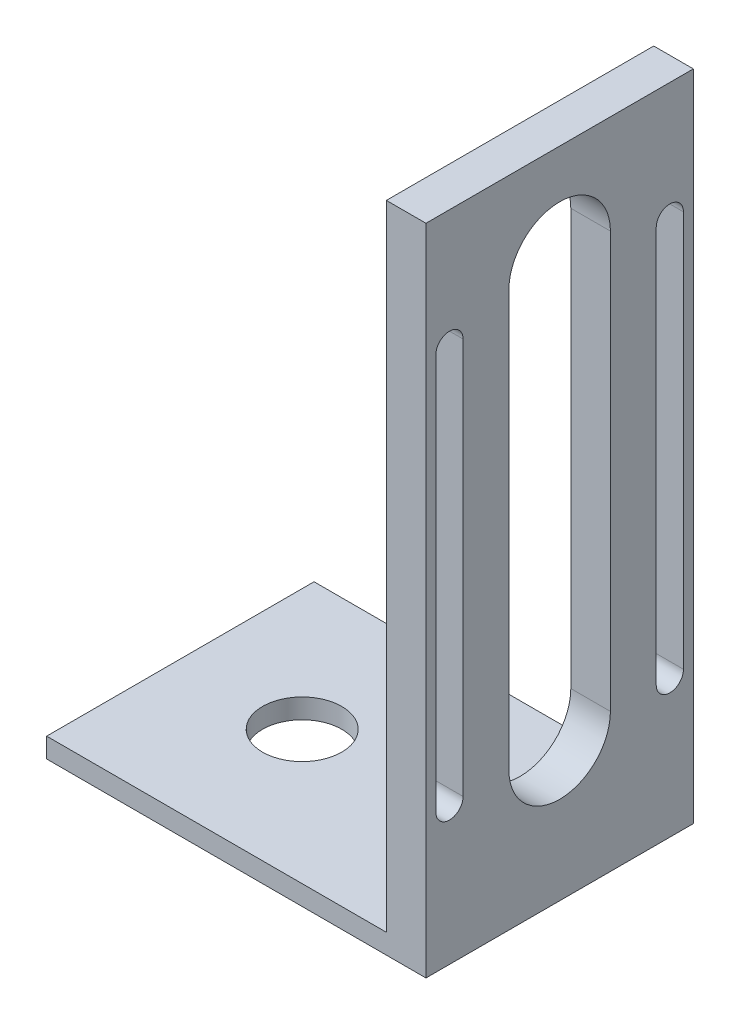
ISO-10303-21;
HEADER;
FILE_DESCRIPTION(('STEP AP214'),'2;1');
FILE_NAME('part.step','',(''),(''),'','','');
FILE_SCHEMA(('AUTOMOTIVE_DESIGN { 1 0 10303 214 1 1 1 1 }'));
ENDSEC;
DATA;
#1=APPLICATION_CONTEXT('core data for automotive mechanical design processes');
#2=APPLICATION_PROTOCOL_DEFINITION('international standard','automotive_design',2000,#1);
#3=PRODUCT_CONTEXT('',#1,'mechanical');
#4=PRODUCT('Part','Part','',(#3));
#5=PRODUCT_RELATED_PRODUCT_CATEGORY('part','',(#4));
#6=PRODUCT_DEFINITION_FORMATION('','',#4);
#7=PRODUCT_DEFINITION_CONTEXT('part definition',#1,'design');
#8=PRODUCT_DEFINITION('design','',#6,#7);
#9=PRODUCT_DEFINITION_SHAPE('','',#8);
#10=(LENGTH_UNIT() NAMED_UNIT(*) SI_UNIT(.MILLI.,.METRE.));
#11=(NAMED_UNIT(*) PLANE_ANGLE_UNIT() SI_UNIT($,.RADIAN.));
#12=(NAMED_UNIT(*) SI_UNIT($,.STERADIAN.) SOLID_ANGLE_UNIT());
#13=UNCERTAINTY_MEASURE_WITH_UNIT(LENGTH_MEASURE(1.E-05),#10,'distance_accuracy_value','');
#14=(GEOMETRIC_REPRESENTATION_CONTEXT(3) GLOBAL_UNCERTAINTY_ASSIGNED_CONTEXT((#13)) GLOBAL_UNIT_ASSIGNED_CONTEXT((#10,
#11,#12)) REPRESENTATION_CONTEXT('',''));
#15=CARTESIAN_POINT('',(0.,0.,0.));
#16=DIRECTION('',(0.,0.,1.));
#17=DIRECTION('',(1.,0.,0.));
#18=AXIS2_PLACEMENT_3D('',#15,#16,#17);
#19=CARTESIAN_POINT('',(0.,2.,0.));
#20=DIRECTION('',(0.,1.,0.));
#21=DIRECTION('',(0.,0.,1.));
#22=AXIS2_PLACEMENT_3D('',#19,#20,#21);
#23=PLANE('',#22);
#24=DIRECTION('',(0.,0.,1.));
#25=VECTOR('',#24,1.);
#26=CARTESIAN_POINT('',(15.15,2.,-13.5));
#27=LINE('',#26,#25);
#28=CARTESIAN_POINT('',(15.15,2.,-13.5));
#29=VERTEX_POINT('',#28);
#30=CARTESIAN_POINT('',(15.15,2.,13.5));
#31=VERTEX_POINT('',#30);
#32=EDGE_CURVE('E184',#29,#31,#27,.T.);
#33=ORIENTED_EDGE('',*,*,#32,.F.);
#34=DIRECTION('',(-1.,0.,0.));
#35=VECTOR('',#34,1.);
#36=CARTESIAN_POINT('',(-19.15,2.,-13.5));
#37=LINE('',#36,#35);
#38=CARTESIAN_POINT('',(-19.15,2.,-13.5));
#39=VERTEX_POINT('',#38);
#40=EDGE_CURVE('E334',#29,#39,#37,.T.);
#41=ORIENTED_EDGE('',*,*,#40,.T.);
#42=DIRECTION('',(0.,0.,1.));
#43=VECTOR('',#42,1.);
#44=CARTESIAN_POINT('',(-19.15,2.,-13.5));
#45=LINE('',#44,#43);
#46=CARTESIAN_POINT('',(-19.15,2.,13.5));
#47=VERTEX_POINT('',#46);
#48=EDGE_CURVE('E337',#39,#47,#45,.T.);
#49=ORIENTED_EDGE('',*,*,#48,.T.);
#50=DIRECTION('',(1.,0.,0.));
#51=VECTOR('',#50,1.);
#52=CARTESIAN_POINT('',(-19.15,2.,13.5));
#53=LINE('',#52,#51);
#54=EDGE_CURVE('E341',#47,#31,#53,.T.);
#55=ORIENTED_EDGE('',*,*,#54,.T.);
#56=EDGE_LOOP('',(#33,#41,#49,#55));
#57=FACE_BOUND('',#56,.T.);
#58=CARTESIAN_POINT('',(-6.85,2.,0.));
#59=DIRECTION('',(0.,1.,0.));
#60=DIRECTION('',(0.,0.,1.));
#61=AXIS2_PLACEMENT_3D('',#58,#59,#60);
#62=CIRCLE('',#61,4.);
#63=CARTESIAN_POINT('',(-6.85,2.,4.));
#64=VERTEX_POINT('',#63);
#65=EDGE_CURVE('E326',#64,#64,#62,.T.);
#66=ORIENTED_EDGE('',*,*,#65,.F.);
#67=EDGE_LOOP('',(#66));
#68=FACE_BOUND('',#67,.T.);
#69=ADVANCED_FACE('F38',(#57,#68),#23,.T.);
#70=CARTESIAN_POINT('',(0.,0.,0.));
#71=DIRECTION('',(0.,1.,0.));
#72=DIRECTION('',(0.,0.,1.));
#73=AXIS2_PLACEMENT_3D('',#70,#71,#72);
#74=PLANE('',#73);
#75=DIRECTION('',(0.,0.,-1.));
#76=VECTOR('',#75,1.);
#77=CARTESIAN_POINT('',(19.15,0.,-13.5));
#78=LINE('',#77,#76);
#79=CARTESIAN_POINT('',(19.15,0.,13.5));
#80=VERTEX_POINT('',#79);
#81=CARTESIAN_POINT('',(19.15,0.,-13.5));
#82=VERTEX_POINT('',#81);
#83=EDGE_CURVE('E330',#80,#82,#78,.T.);
#84=ORIENTED_EDGE('',*,*,#83,.F.);
#85=DIRECTION('',(1.,0.,0.));
#86=VECTOR('',#85,1.);
#87=CARTESIAN_POINT('',(-19.15,0.,13.5));
#88=LINE('',#87,#86);
#89=CARTESIAN_POINT('',(-19.15,0.,13.5));
#90=VERTEX_POINT('',#89);
#91=EDGE_CURVE('E338',#90,#80,#88,.T.);
#92=ORIENTED_EDGE('',*,*,#91,.F.);
#93=DIRECTION('',(0.,0.,1.));
#94=VECTOR('',#93,1.);
#95=CARTESIAN_POINT('',(-19.15,0.,-13.5));
#96=LINE('',#95,#94);
#97=CARTESIAN_POINT('',(-19.15,0.,-13.5));
#98=VERTEX_POINT('',#97);
#99=EDGE_CURVE('E351',#98,#90,#96,.T.);
#100=ORIENTED_EDGE('',*,*,#99,.F.);
#101=DIRECTION('',(-1.,0.,0.));
#102=VECTOR('',#101,1.);
#103=CARTESIAN_POINT('',(-19.15,0.,-13.5));
#104=LINE('',#103,#102);
#105=EDGE_CURVE('E348',#82,#98,#104,.T.);
#106=ORIENTED_EDGE('',*,*,#105,.F.);
#107=EDGE_LOOP('',(#84,#92,#100,#106));
#108=FACE_BOUND('',#107,.T.);
#109=CARTESIAN_POINT('',(-6.85,0.,0.));
#110=DIRECTION('',(0.,1.,0.));
#111=DIRECTION('',(0.,0.,1.));
#112=AXIS2_PLACEMENT_3D('',#109,#110,#111);
#113=CIRCLE('',#112,4.);
#114=CARTESIAN_POINT('',(-6.85,0.,4.));
#115=VERTEX_POINT('',#114);
#116=EDGE_CURVE('E325',#115,#115,#113,.T.);
#117=ORIENTED_EDGE('',*,*,#116,.T.);
#118=EDGE_LOOP('',(#117));
#119=FACE_BOUND('',#118,.T.);
#120=ADVANCED_FACE('F375',(#108,#119),#74,.F.);
#121=CARTESIAN_POINT('',(19.15,2.,-13.5));
#122=DIRECTION('',(-1.,0.,0.));
#123=DIRECTION('',(0.,0.,1.));
#124=AXIS2_PLACEMENT_3D('',#121,#122,#123);
#125=PLANE('',#124);
#126=DIRECTION('',(0.,1.,0.));
#127=VECTOR('',#126,1.);
#128=CARTESIAN_POINT('',(19.15,14.,-12.5));
#129=LINE('',#128,#127);
#130=CARTESIAN_POINT('',(19.15,14.,-12.5));
#131=VERTEX_POINT('',#130);
#132=CARTESIAN_POINT('',(19.15,54.,-12.5));
#133=VERTEX_POINT('',#132);
#134=EDGE_CURVE('E189',#131,#133,#129,.T.);
#135=ORIENTED_EDGE('',*,*,#134,.F.);
#136=CARTESIAN_POINT('',(19.15,14.,-11.125));
#137=DIRECTION('',(-1.,0.,0.));
#138=DIRECTION('',(0.,0.,1.));
#139=AXIS2_PLACEMENT_3D('',#136,#137,#138);
#140=CIRCLE('',#139,1.375);
#141=CARTESIAN_POINT('',(19.15,14.,-9.75));
#142=VERTEX_POINT('',#141);
#143=EDGE_CURVE('E168',#142,#131,#140,.F.);
#144=ORIENTED_EDGE('',*,*,#143,.F.);
#145=DIRECTION('',(0.,-1.,0.));
#146=VECTOR('',#145,1.);
#147=CARTESIAN_POINT('',(19.15,14.,-9.75));
#148=LINE('',#147,#146);
#149=CARTESIAN_POINT('',(19.15,54.,-9.75));
#150=VERTEX_POINT('',#149);
#151=EDGE_CURVE('E180',#150,#142,#148,.T.);
#152=ORIENTED_EDGE('',*,*,#151,.F.);
#153=CARTESIAN_POINT('',(19.15,54.,-11.125));
#154=DIRECTION('',(-1.,0.,0.));
#155=DIRECTION('',(0.,0.,1.));
#156=AXIS2_PLACEMENT_3D('',#153,#154,#155);
#157=CIRCLE('',#156,1.375);
#158=EDGE_CURVE('E54',#133,#150,#157,.F.);
#159=ORIENTED_EDGE('',*,*,#158,.F.);
#160=EDGE_LOOP('',(#135,#144,#152,#159));
#161=FACE_BOUND('',#160,.T.);
#162=DIRECTION('',(0.,1.,0.));
#163=VECTOR('',#162,1.);
#164=CARTESIAN_POINT('',(19.15,14.,9.75));
#165=LINE('',#164,#163);
#166=CARTESIAN_POINT('',(19.15,14.,9.75));
#167=VERTEX_POINT('',#166);
#168=CARTESIAN_POINT('',(19.15,54.,9.75));
#169=VERTEX_POINT('',#168);
#170=EDGE_CURVE('E217',#167,#169,#165,.T.);
#171=ORIENTED_EDGE('',*,*,#170,.F.);
#172=CARTESIAN_POINT('',(19.15,14.,11.125));
#173=DIRECTION('',(-1.,0.,0.));
#174=DIRECTION('',(0.,0.,1.));
#175=AXIS2_PLACEMENT_3D('',#172,#173,#174);
#176=CIRCLE('',#175,1.375);
#177=CARTESIAN_POINT('',(19.15,14.,12.5));
#178=VERTEX_POINT('',#177);
#179=EDGE_CURVE('E222',#178,#167,#176,.F.);
#180=ORIENTED_EDGE('',*,*,#179,.F.);
#181=DIRECTION('',(0.,-1.,0.));
#182=VECTOR('',#181,1.);
#183=CARTESIAN_POINT('',(19.15,14.,12.5));
#184=LINE('',#183,#182);
#185=CARTESIAN_POINT('',(19.15,54.,12.5));
#186=VERTEX_POINT('',#185);
#187=EDGE_CURVE('E245',#186,#178,#184,.T.);
#188=ORIENTED_EDGE('',*,*,#187,.F.);
#189=CARTESIAN_POINT('',(19.15,54.,11.125));
#190=DIRECTION('',(-1.,0.,0.));
#191=DIRECTION('',(0.,0.,1.));
#192=AXIS2_PLACEMENT_3D('',#189,#190,#191);
#193=CIRCLE('',#192,1.375);
#194=EDGE_CURVE('E62',#169,#186,#193,.F.);
#195=ORIENTED_EDGE('',*,*,#194,.F.);
#196=EDGE_LOOP('',(#171,#180,#188,#195));
#197=FACE_BOUND('',#196,.T.);
#198=DIRECTION('',(0.,1.,0.));
#199=VECTOR('',#198,1.);
#200=CARTESIAN_POINT('',(19.15,14.,-5.125));
#201=LINE('',#200,#199);
#202=CARTESIAN_POINT('',(19.15,14.,-5.125));
#203=VERTEX_POINT('',#202);
#204=CARTESIAN_POINT('',(19.15,56.,-5.125));
#205=VERTEX_POINT('',#204);
#206=EDGE_CURVE('E261',#203,#205,#201,.T.);
#207=ORIENTED_EDGE('',*,*,#206,.F.);
#208=CARTESIAN_POINT('',(19.15,14.,0.));
#209=DIRECTION('',(-1.,0.,0.));
#210=DIRECTION('',(0.,0.,1.));
#211=AXIS2_PLACEMENT_3D('',#208,#209,#210);
#212=CIRCLE('',#211,5.125);
#213=CARTESIAN_POINT('',(19.15,14.,5.125));
#214=VERTEX_POINT('',#213);
#215=EDGE_CURVE('E265',#214,#203,#212,.F.);
#216=ORIENTED_EDGE('',*,*,#215,.F.);
#217=DIRECTION('',(0.,-1.,0.));
#218=VECTOR('',#217,1.);
#219=CARTESIAN_POINT('',(19.15,14.,5.125));
#220=LINE('',#219,#218);
#221=CARTESIAN_POINT('',(19.15,56.,5.125));
#222=VERTEX_POINT('',#221);
#223=EDGE_CURVE('E218',#222,#214,#220,.T.);
#224=ORIENTED_EDGE('',*,*,#223,.F.);
#225=CARTESIAN_POINT('',(19.15,56.,0.));
#226=DIRECTION('',(-1.,0.,0.));
#227=DIRECTION('',(0.,0.,1.));
#228=AXIS2_PLACEMENT_3D('',#225,#226,#227);
#229=CIRCLE('',#228,5.125);
#230=EDGE_CURVE('E258',#205,#222,#229,.F.);
#231=ORIENTED_EDGE('',*,*,#230,.F.);
#232=EDGE_LOOP('',(#207,#216,#224,#231));
#233=FACE_BOUND('',#232,.T.);
#234=ORIENTED_EDGE('',*,*,#83,.T.);
#235=DIRECTION('',(0.,-1.,0.));
#236=VECTOR('',#235,1.);
#237=CARTESIAN_POINT('',(19.15,2.,-13.5));
#238=LINE('',#237,#236);
#239=CARTESIAN_POINT('',(19.15,66.,-13.5));
#240=VERTEX_POINT('',#239);
#241=EDGE_CURVE('E11',#240,#82,#238,.T.);
#242=ORIENTED_EDGE('',*,*,#241,.F.);
#243=DIRECTION('',(0.,0.,-1.));
#244=VECTOR('',#243,1.);
#245=CARTESIAN_POINT('',(19.15,66.,-13.5));
#246=LINE('',#245,#244);
#247=CARTESIAN_POINT('',(19.15,66.,13.5));
#248=VERTEX_POINT('',#247);
#249=EDGE_CURVE('E300',#248,#240,#246,.T.);
#250=ORIENTED_EDGE('',*,*,#249,.F.);
#251=DIRECTION('',(0.,-1.,0.));
#252=VECTOR('',#251,1.);
#253=CARTESIAN_POINT('',(19.15,2.,13.5));
#254=LINE('',#253,#252);
#255=EDGE_CURVE('E344',#248,#80,#254,.T.);
#256=ORIENTED_EDGE('',*,*,#255,.T.);
#257=EDGE_LOOP('',(#234,#242,#250,#256));
#258=FACE_BOUND('',#257,.T.);
#259=ADVANCED_FACE('F40',(#161,#197,#233,#258),#125,.F.);
#260=CARTESIAN_POINT('',(-19.15,2.,-13.5));
#261=DIRECTION('',(0.,0.,1.));
#262=DIRECTION('',(1.,0.,0.));
#263=AXIS2_PLACEMENT_3D('',#260,#261,#262);
#264=PLANE('',#263);
#265=ORIENTED_EDGE('',*,*,#105,.T.);
#266=DIRECTION('',(0.,-1.,0.));
#267=VECTOR('',#266,1.);
#268=CARTESIAN_POINT('',(-19.15,2.,-13.5));
#269=LINE('',#268,#267);
#270=EDGE_CURVE('E47',#39,#98,#269,.T.);
#271=ORIENTED_EDGE('',*,*,#270,.F.);
#272=ORIENTED_EDGE('',*,*,#40,.F.);
#273=DIRECTION('',(0.,-1.,0.));
#274=VECTOR('',#273,1.);
#275=CARTESIAN_POINT('',(15.15,66.,-13.5));
#276=LINE('',#275,#274);
#277=CARTESIAN_POINT('',(15.15,66.,-13.5));
#278=VERTEX_POINT('',#277);
#279=EDGE_CURVE('E321',#278,#29,#276,.T.);
#280=ORIENTED_EDGE('',*,*,#279,.F.);
#281=DIRECTION('',(-1.,0.,0.));
#282=VECTOR('',#281,1.);
#283=CARTESIAN_POINT('',(19.15,66.,-13.5));
#284=LINE('',#283,#282);
#285=EDGE_CURVE('E304',#240,#278,#284,.T.);
#286=ORIENTED_EDGE('',*,*,#285,.F.);
#287=ORIENTED_EDGE('',*,*,#241,.T.);
#288=EDGE_LOOP('',(#265,#271,#272,#280,#286,#287));
#289=FACE_BOUND('',#288,.T.);
#290=ADVANCED_FACE('F393',(#289),#264,.F.);
#291=CARTESIAN_POINT('',(-19.15,2.,-13.5));
#292=DIRECTION('',(1.,0.,0.));
#293=DIRECTION('',(0.,0.,-1.));
#294=AXIS2_PLACEMENT_3D('',#291,#292,#293);
#295=PLANE('',#294);
#296=ORIENTED_EDGE('',*,*,#99,.T.);
#297=DIRECTION('',(0.,-1.,0.));
#298=VECTOR('',#297,1.);
#299=CARTESIAN_POINT('',(-19.15,2.,13.5));
#300=LINE('',#299,#298);
#301=EDGE_CURVE('E359',#47,#90,#300,.T.);
#302=ORIENTED_EDGE('',*,*,#301,.F.);
#303=ORIENTED_EDGE('',*,*,#48,.F.);
#304=ORIENTED_EDGE('',*,*,#270,.T.);
#305=EDGE_LOOP('',(#296,#302,#303,#304));
#306=FACE_BOUND('',#305,.T.);
#307=ADVANCED_FACE('F368',(#306),#295,.F.);
#308=CARTESIAN_POINT('',(-19.15,2.,13.5));
#309=DIRECTION('',(0.,0.,-1.));
#310=DIRECTION('',(-1.,0.,0.));
#311=AXIS2_PLACEMENT_3D('',#308,#309,#310);
#312=PLANE('',#311);
#313=ORIENTED_EDGE('',*,*,#91,.T.);
#314=ORIENTED_EDGE('',*,*,#255,.F.);
#315=DIRECTION('',(1.,0.,0.));
#316=VECTOR('',#315,1.);
#317=CARTESIAN_POINT('',(19.15,66.,13.5));
#318=LINE('',#317,#316);
#319=CARTESIAN_POINT('',(15.15,66.,13.5));
#320=VERTEX_POINT('',#319);
#321=EDGE_CURVE('E310',#320,#248,#318,.T.);
#322=ORIENTED_EDGE('',*,*,#321,.F.);
#323=DIRECTION('',(0.,-1.,0.));
#324=VECTOR('',#323,1.);
#325=CARTESIAN_POINT('',(15.15,66.,13.5));
#326=LINE('',#325,#324);
#327=EDGE_CURVE('E314',#320,#31,#326,.T.);
#328=ORIENTED_EDGE('',*,*,#327,.T.);
#329=ORIENTED_EDGE('',*,*,#54,.F.);
#330=ORIENTED_EDGE('',*,*,#301,.T.);
#331=EDGE_LOOP('',(#313,#314,#322,#328,#329,#330));
#332=FACE_BOUND('',#331,.T.);
#333=ADVANCED_FACE('F378',(#332),#312,.F.);
#334=CARTESIAN_POINT('',(-6.85,2.,0.));
#335=DIRECTION('',(0.,-1.,0.));
#336=DIRECTION('',(0.,0.,-1.));
#337=AXIS2_PLACEMENT_3D('',#334,#335,#336);
#338=CYLINDRICAL_SURFACE('',#337,4.);
#339=ORIENTED_EDGE('',*,*,#65,.T.);
#340=EDGE_LOOP('',(#339));
#341=FACE_BOUND('',#340,.T.);
#342=ORIENTED_EDGE('',*,*,#116,.F.);
#343=EDGE_LOOP('',(#342));
#344=FACE_BOUND('',#343,.T.);
#345=ADVANCED_FACE('F408',(#341,#344),#338,.F.);
#346=CARTESIAN_POINT('',(15.15,66.,-13.5));
#347=DIRECTION('',(1.,0.,0.));
#348=DIRECTION('',(0.,0.,-1.));
#349=AXIS2_PLACEMENT_3D('',#346,#347,#348);
#350=PLANE('',#349);
#351=DIRECTION('',(0.,1.,0.));
#352=VECTOR('',#351,1.);
#353=CARTESIAN_POINT('',(15.15,14.,-9.75));
#354=LINE('',#353,#352);
#355=CARTESIAN_POINT('',(15.15,14.,-9.75));
#356=VERTEX_POINT('',#355);
#357=CARTESIAN_POINT('',(15.15,54.,-9.75));
#358=VERTEX_POINT('',#357);
#359=EDGE_CURVE('E194',#356,#358,#354,.T.);
#360=ORIENTED_EDGE('',*,*,#359,.F.);
#361=CARTESIAN_POINT('',(15.15,14.,-11.125));
#362=DIRECTION('',(-1.,0.,0.));
#363=DIRECTION('',(0.,0.,1.));
#364=AXIS2_PLACEMENT_3D('',#361,#362,#363);
#365=CIRCLE('',#364,1.375);
#366=CARTESIAN_POINT('',(15.15,14.,-12.5));
#367=VERTEX_POINT('',#366);
#368=EDGE_CURVE('E171',#367,#356,#365,.T.);
#369=ORIENTED_EDGE('',*,*,#368,.F.);
#370=DIRECTION('',(0.,-1.,0.));
#371=VECTOR('',#370,1.);
#372=CARTESIAN_POINT('',(15.15,14.,-12.5));
#373=LINE('',#372,#371);
#374=CARTESIAN_POINT('',(15.15,54.,-12.5));
#375=VERTEX_POINT('',#374);
#376=EDGE_CURVE('E177',#375,#367,#373,.T.);
#377=ORIENTED_EDGE('',*,*,#376,.F.);
#378=CARTESIAN_POINT('',(15.15,54.,-11.125));
#379=DIRECTION('',(-1.,0.,0.));
#380=DIRECTION('',(0.,0.,1.));
#381=AXIS2_PLACEMENT_3D('',#378,#379,#380);
#382=CIRCLE('',#381,1.375);
#383=EDGE_CURVE('E201',#358,#375,#382,.T.);
#384=ORIENTED_EDGE('',*,*,#383,.F.);
#385=EDGE_LOOP('',(#360,#369,#377,#384));
#386=FACE_BOUND('',#385,.T.);
#387=DIRECTION('',(0.,1.,0.));
#388=VECTOR('',#387,1.);
#389=CARTESIAN_POINT('',(15.15,14.,12.5));
#390=LINE('',#389,#388);
#391=CARTESIAN_POINT('',(15.15,14.,12.5));
#392=VERTEX_POINT('',#391);
#393=CARTESIAN_POINT('',(15.15,54.,12.5));
#394=VERTEX_POINT('',#393);
#395=EDGE_CURVE('E229',#392,#394,#390,.T.);
#396=ORIENTED_EDGE('',*,*,#395,.F.);
#397=CARTESIAN_POINT('',(15.15,14.,11.125));
#398=DIRECTION('',(-1.,0.,0.));
#399=DIRECTION('',(0.,0.,-1.));
#400=AXIS2_PLACEMENT_3D('',#397,#398,#399);
#401=CIRCLE('',#400,1.375);
#402=CARTESIAN_POINT('',(15.15,14.,9.75));
#403=VERTEX_POINT('',#402);
#404=EDGE_CURVE('E226',#403,#392,#401,.T.);
#405=ORIENTED_EDGE('',*,*,#404,.F.);
#406=DIRECTION('',(0.,-1.,0.));
#407=VECTOR('',#406,1.);
#408=CARTESIAN_POINT('',(15.15,14.,9.75));
#409=LINE('',#408,#407);
#410=CARTESIAN_POINT('',(15.15,54.,9.75));
#411=VERTEX_POINT('',#410);
#412=EDGE_CURVE('E237',#411,#403,#409,.T.);
#413=ORIENTED_EDGE('',*,*,#412,.F.);
#414=CARTESIAN_POINT('',(15.15,54.,11.125));
#415=DIRECTION('',(-1.,0.,0.));
#416=DIRECTION('',(0.,0.,-1.));
#417=AXIS2_PLACEMENT_3D('',#414,#415,#416);
#418=CIRCLE('',#417,1.375);
#419=EDGE_CURVE('E233',#394,#411,#418,.T.);
#420=ORIENTED_EDGE('',*,*,#419,.F.);
#421=EDGE_LOOP('',(#396,#405,#413,#420));
#422=FACE_BOUND('',#421,.T.);
#423=DIRECTION('',(0.,1.,0.));
#424=VECTOR('',#423,1.);
#425=CARTESIAN_POINT('',(15.15,14.,5.125));
#426=LINE('',#425,#424);
#427=CARTESIAN_POINT('',(15.15,14.,5.125));
#428=VERTEX_POINT('',#427);
#429=CARTESIAN_POINT('',(15.15,56.,5.125));
#430=VERTEX_POINT('',#429);
#431=EDGE_CURVE('E272',#428,#430,#426,.T.);
#432=ORIENTED_EDGE('',*,*,#431,.F.);
#433=CARTESIAN_POINT('',(15.15,14.,0.));
#434=DIRECTION('',(-1.,0.,0.));
#435=DIRECTION('',(0.,0.,1.));
#436=AXIS2_PLACEMENT_3D('',#433,#434,#435);
#437=CIRCLE('',#436,5.125);
#438=CARTESIAN_POINT('',(15.15,14.,-5.125));
#439=VERTEX_POINT('',#438);
#440=EDGE_CURVE('E269',#439,#428,#437,.T.);
#441=ORIENTED_EDGE('',*,*,#440,.F.);
#442=DIRECTION('',(0.,-1.,0.));
#443=VECTOR('',#442,1.);
#444=CARTESIAN_POINT('',(15.15,14.,-5.125));
#445=LINE('',#444,#443);
#446=CARTESIAN_POINT('',(15.15,56.,-5.125));
#447=VERTEX_POINT('',#446);
#448=EDGE_CURVE('E280',#447,#439,#445,.T.);
#449=ORIENTED_EDGE('',*,*,#448,.F.);
#450=CARTESIAN_POINT('',(15.15,56.,0.));
#451=DIRECTION('',(-1.,0.,0.));
#452=DIRECTION('',(0.,0.,1.));
#453=AXIS2_PLACEMENT_3D('',#450,#451,#452);
#454=CIRCLE('',#453,5.125);
#455=EDGE_CURVE('E276',#430,#447,#454,.T.);
#456=ORIENTED_EDGE('',*,*,#455,.F.);
#457=EDGE_LOOP('',(#432,#441,#449,#456));
#458=FACE_BOUND('',#457,.T.);
#459=ORIENTED_EDGE('',*,*,#32,.T.);
#460=ORIENTED_EDGE('',*,*,#327,.F.);
#461=DIRECTION('',(0.,0.,1.));
#462=VECTOR('',#461,1.);
#463=CARTESIAN_POINT('',(15.15,66.,-13.5));
#464=LINE('',#463,#462);
#465=EDGE_CURVE('E307',#278,#320,#464,.T.);
#466=ORIENTED_EDGE('',*,*,#465,.F.);
#467=ORIENTED_EDGE('',*,*,#279,.T.);
#468=EDGE_LOOP('',(#459,#460,#466,#467));
#469=FACE_BOUND('',#468,.T.);
#470=ADVANCED_FACE('F390',(#386,#422,#458,#469),#350,.F.);
#471=CARTESIAN_POINT('',(0.,66.,0.));
#472=DIRECTION('',(0.,-1.,0.));
#473=DIRECTION('',(0.,0.,-1.));
#474=AXIS2_PLACEMENT_3D('',#471,#472,#473);
#475=PLANE('',#474);
#476=ORIENTED_EDGE('',*,*,#249,.T.);
#477=ORIENTED_EDGE('',*,*,#285,.T.);
#478=ORIENTED_EDGE('',*,*,#465,.T.);
#479=ORIENTED_EDGE('',*,*,#321,.T.);
#480=EDGE_LOOP('',(#476,#477,#478,#479));
#481=FACE_BOUND('',#480,.T.);
#482=ADVANCED_FACE('F385',(#481),#475,.F.);
#483=CARTESIAN_POINT('',(19.151,14.,0.));
#484=DIRECTION('',(-1.,0.,0.));
#485=DIRECTION('',(0.,0.,1.));
#486=AXIS2_PLACEMENT_3D('',#483,#484,#485);
#487=CYLINDRICAL_SURFACE('',#486,5.125);
#488=ORIENTED_EDGE('',*,*,#215,.T.);
#489=DIRECTION('',(-1.,0.,0.));
#490=VECTOR('',#489,1.);
#491=CARTESIAN_POINT('',(19.151,14.,-5.125));
#492=LINE('',#491,#490);
#493=EDGE_CURVE('E285',#203,#439,#492,.T.);
#494=ORIENTED_EDGE('',*,*,#493,.T.);
#495=ORIENTED_EDGE('',*,*,#440,.T.);
#496=DIRECTION('',(-1.,0.,0.));
#497=VECTOR('',#496,1.);
#498=CARTESIAN_POINT('',(19.151,14.,5.125));
#499=LINE('',#498,#497);
#500=EDGE_CURVE('E284',#214,#428,#499,.T.);
#501=ORIENTED_EDGE('',*,*,#500,.F.);
#502=EDGE_LOOP('',(#488,#494,#495,#501));
#503=FACE_BOUND('',#502,.T.);
#504=ADVANCED_FACE('F427',(#503),#487,.F.);
#505=CARTESIAN_POINT('',(19.151,14.,-5.125));
#506=DIRECTION('',(0.,0.,-1.));
#507=DIRECTION('',(0.,1.,0.));
#508=AXIS2_PLACEMENT_3D('',#505,#506,#507);
#509=PLANE('',#508);
#510=ORIENTED_EDGE('',*,*,#206,.T.);
#511=DIRECTION('',(-1.,0.,0.));
#512=VECTOR('',#511,1.);
#513=CARTESIAN_POINT('',(19.151,56.,-5.125));
#514=LINE('',#513,#512);
#515=EDGE_CURVE('E288',#205,#447,#514,.T.);
#516=ORIENTED_EDGE('',*,*,#515,.T.);
#517=ORIENTED_EDGE('',*,*,#448,.T.);
#518=ORIENTED_EDGE('',*,*,#493,.F.);
#519=EDGE_LOOP('',(#510,#516,#517,#518));
#520=FACE_BOUND('',#519,.T.);
#521=ADVANCED_FACE('F433',(#520),#509,.F.);
#522=CARTESIAN_POINT('',(19.151,56.,0.));
#523=DIRECTION('',(-1.,0.,0.));
#524=DIRECTION('',(0.,0.,1.));
#525=AXIS2_PLACEMENT_3D('',#522,#523,#524);
#526=CYLINDRICAL_SURFACE('',#525,5.125);
#527=ORIENTED_EDGE('',*,*,#230,.T.);
#528=DIRECTION('',(-1.,0.,0.));
#529=VECTOR('',#528,1.);
#530=CARTESIAN_POINT('',(19.151,56.,5.125));
#531=LINE('',#530,#529);
#532=EDGE_CURVE('E291',#222,#430,#531,.T.);
#533=ORIENTED_EDGE('',*,*,#532,.T.);
#534=ORIENTED_EDGE('',*,*,#455,.T.);
#535=ORIENTED_EDGE('',*,*,#515,.F.);
#536=EDGE_LOOP('',(#527,#533,#534,#535));
#537=FACE_BOUND('',#536,.T.);
#538=ADVANCED_FACE('F439',(#537),#526,.F.);
#539=CARTESIAN_POINT('',(19.151,14.,5.125));
#540=DIRECTION('',(0.,0.,1.));
#541=DIRECTION('',(0.,-1.,0.));
#542=AXIS2_PLACEMENT_3D('',#539,#540,#541);
#543=PLANE('',#542);
#544=ORIENTED_EDGE('',*,*,#223,.T.);
#545=ORIENTED_EDGE('',*,*,#500,.T.);
#546=ORIENTED_EDGE('',*,*,#431,.T.);
#547=ORIENTED_EDGE('',*,*,#532,.F.);
#548=EDGE_LOOP('',(#544,#545,#546,#547));
#549=FACE_BOUND('',#548,.T.);
#550=ADVANCED_FACE('F435',(#549),#543,.F.);
#551=CARTESIAN_POINT('',(19.151,14.,11.125));
#552=DIRECTION('',(-1.,0.,0.));
#553=DIRECTION('',(0.,0.,1.));
#554=AXIS2_PLACEMENT_3D('',#551,#552,#553);
#555=CYLINDRICAL_SURFACE('',#554,1.375);
#556=ORIENTED_EDGE('',*,*,#179,.T.);
#557=DIRECTION('',(-1.,0.,0.));
#558=VECTOR('',#557,1.);
#559=CARTESIAN_POINT('',(19.151,14.,9.75));
#560=LINE('',#559,#558);
#561=EDGE_CURVE('E242',#167,#403,#560,.T.);
#562=ORIENTED_EDGE('',*,*,#561,.T.);
#563=ORIENTED_EDGE('',*,*,#404,.T.);
#564=DIRECTION('',(-1.,0.,0.));
#565=VECTOR('',#564,1.);
#566=CARTESIAN_POINT('',(19.151,14.,12.5));
#567=LINE('',#566,#565);
#568=EDGE_CURVE('E241',#178,#392,#567,.T.);
#569=ORIENTED_EDGE('',*,*,#568,.F.);
#570=EDGE_LOOP('',(#556,#562,#563,#569));
#571=FACE_BOUND('',#570,.T.);
#572=ADVANCED_FACE('F438',(#571),#555,.F.);
#573=CARTESIAN_POINT('',(19.151,14.,9.75));
#574=DIRECTION('',(0.,0.,-1.));
#575=DIRECTION('',(0.,1.,0.));
#576=AXIS2_PLACEMENT_3D('',#573,#574,#575);
#577=PLANE('',#576);
#578=ORIENTED_EDGE('',*,*,#170,.T.);
#579=DIRECTION('',(-1.,0.,0.));
#580=VECTOR('',#579,1.);
#581=CARTESIAN_POINT('',(19.151,54.,9.75));
#582=LINE('',#581,#580);
#583=EDGE_CURVE('E246',#169,#411,#582,.T.);
#584=ORIENTED_EDGE('',*,*,#583,.T.);
#585=ORIENTED_EDGE('',*,*,#412,.T.);
#586=ORIENTED_EDGE('',*,*,#561,.F.);
#587=EDGE_LOOP('',(#578,#584,#585,#586));
#588=FACE_BOUND('',#587,.T.);
#589=ADVANCED_FACE('F449',(#588),#577,.F.);
#590=CARTESIAN_POINT('',(19.151,54.,11.125));
#591=DIRECTION('',(-1.,0.,0.));
#592=DIRECTION('',(0.,0.,1.));
#593=AXIS2_PLACEMENT_3D('',#590,#591,#592);
#594=CYLINDRICAL_SURFACE('',#593,1.375);
#595=ORIENTED_EDGE('',*,*,#194,.T.);
#596=DIRECTION('',(-1.,0.,0.));
#597=VECTOR('',#596,1.);
#598=CARTESIAN_POINT('',(19.151,54.,12.5));
#599=LINE('',#598,#597);
#600=EDGE_CURVE('E249',#186,#394,#599,.T.);
#601=ORIENTED_EDGE('',*,*,#600,.T.);
#602=ORIENTED_EDGE('',*,*,#419,.T.);
#603=ORIENTED_EDGE('',*,*,#583,.F.);
#604=EDGE_LOOP('',(#595,#601,#602,#603));
#605=FACE_BOUND('',#604,.T.);
#606=ADVANCED_FACE('F454',(#605),#594,.F.);
#607=CARTESIAN_POINT('',(19.151,14.,12.5));
#608=DIRECTION('',(0.,0.,1.));
#609=DIRECTION('',(0.,-1.,0.));
#610=AXIS2_PLACEMENT_3D('',#607,#608,#609);
#611=PLANE('',#610);
#612=ORIENTED_EDGE('',*,*,#187,.T.);
#613=ORIENTED_EDGE('',*,*,#568,.T.);
#614=ORIENTED_EDGE('',*,*,#395,.T.);
#615=ORIENTED_EDGE('',*,*,#600,.F.);
#616=EDGE_LOOP('',(#612,#613,#614,#615));
#617=FACE_BOUND('',#616,.T.);
#618=ADVANCED_FACE('F451',(#617),#611,.F.);
#619=CARTESIAN_POINT('',(19.151,14.,-11.125));
#620=DIRECTION('',(-1.,0.,0.));
#621=DIRECTION('',(0.,0.,1.));
#622=AXIS2_PLACEMENT_3D('',#619,#620,#621);
#623=CYLINDRICAL_SURFACE('',#622,1.375);
#624=ORIENTED_EDGE('',*,*,#143,.T.);
#625=DIRECTION('',(-1.,0.,0.));
#626=VECTOR('',#625,1.);
#627=CARTESIAN_POINT('',(19.151,14.,-12.5));
#628=LINE('',#627,#626);
#629=EDGE_CURVE('E185',#131,#367,#628,.T.);
#630=ORIENTED_EDGE('',*,*,#629,.T.);
#631=ORIENTED_EDGE('',*,*,#368,.T.);
#632=DIRECTION('',(-1.,0.,0.));
#633=VECTOR('',#632,1.);
#634=CARTESIAN_POINT('',(19.151,14.,-9.75));
#635=LINE('',#634,#633);
#636=EDGE_CURVE('E164',#142,#356,#635,.T.);
#637=ORIENTED_EDGE('',*,*,#636,.F.);
#638=EDGE_LOOP('',(#624,#630,#631,#637));
#639=FACE_BOUND('',#638,.T.);
#640=ADVANCED_FACE('F166',(#639),#623,.F.);
#641=CARTESIAN_POINT('',(19.151,14.,-12.5));
#642=DIRECTION('',(0.,0.,-1.));
#643=DIRECTION('',(0.,1.,0.));
#644=AXIS2_PLACEMENT_3D('',#641,#642,#643);
#645=PLANE('',#644);
#646=ORIENTED_EDGE('',*,*,#134,.T.);
#647=DIRECTION('',(-1.,0.,0.));
#648=VECTOR('',#647,1.);
#649=CARTESIAN_POINT('',(19.151,54.,-12.5));
#650=LINE('',#649,#648);
#651=EDGE_CURVE('E210',#133,#375,#650,.T.);
#652=ORIENTED_EDGE('',*,*,#651,.T.);
#653=ORIENTED_EDGE('',*,*,#376,.T.);
#654=ORIENTED_EDGE('',*,*,#629,.F.);
#655=EDGE_LOOP('',(#646,#652,#653,#654));
#656=FACE_BOUND('',#655,.T.);
#657=ADVANCED_FACE('F463',(#656),#645,.F.);
#658=CARTESIAN_POINT('',(19.151,54.,-11.125));
#659=DIRECTION('',(-1.,0.,0.));
#660=DIRECTION('',(0.,0.,1.));
#661=AXIS2_PLACEMENT_3D('',#658,#659,#660);
#662=CYLINDRICAL_SURFACE('',#661,1.375);
#663=ORIENTED_EDGE('',*,*,#158,.T.);
#664=DIRECTION('',(-1.,0.,0.));
#665=VECTOR('',#664,1.);
#666=CARTESIAN_POINT('',(19.151,54.,-9.75));
#667=LINE('',#666,#665);
#668=EDGE_CURVE('E176',#150,#358,#667,.T.);
#669=ORIENTED_EDGE('',*,*,#668,.T.);
#670=ORIENTED_EDGE('',*,*,#383,.T.);
#671=ORIENTED_EDGE('',*,*,#651,.F.);
#672=EDGE_LOOP('',(#663,#669,#670,#671));
#673=FACE_BOUND('',#672,.T.);
#674=ADVANCED_FACE('F466',(#673),#662,.F.);
#675=CARTESIAN_POINT('',(19.151,14.,-9.75));
#676=DIRECTION('',(0.,0.,1.));
#677=DIRECTION('',(0.,-1.,0.));
#678=AXIS2_PLACEMENT_3D('',#675,#676,#677);
#679=PLANE('',#678);
#680=ORIENTED_EDGE('',*,*,#151,.T.);
#681=ORIENTED_EDGE('',*,*,#636,.T.);
#682=ORIENTED_EDGE('',*,*,#359,.T.);
#683=ORIENTED_EDGE('',*,*,#668,.F.);
#684=EDGE_LOOP('',(#680,#681,#682,#683));
#685=FACE_BOUND('',#684,.T.);
#686=ADVANCED_FACE('F181',(#685),#679,.F.);
#687=CLOSED_SHELL('',(#69,#120,#259,#290,#307,#333,#345,#470,#482,#504,#521,#538,#550,#572,#589,
#606,#618,#640,#657,#674,#686));
#688=MANIFOLD_SOLID_BREP('B2',#687);
#689=ADVANCED_BREP_SHAPE_REPRESENTATION('',(#18,#688),#14);
#690=SHAPE_DEFINITION_REPRESENTATION(#9,#689);
ENDSEC;
END-ISO-10303-21;
